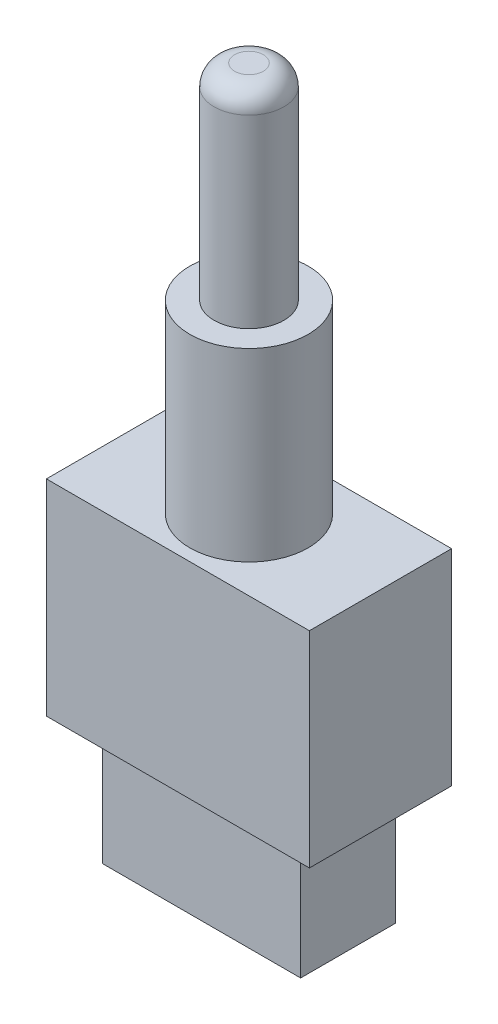
ISO-10303-21;
HEADER;
FILE_DESCRIPTION(('STEP AP214'),'2;1');
FILE_NAME('part.step','',(''),(''),'','','');
FILE_SCHEMA(('AUTOMOTIVE_DESIGN { 1 0 10303 214 1 1 1 1 }'));
ENDSEC;
DATA;
#1=APPLICATION_CONTEXT('core data for automotive mechanical design processes');
#2=APPLICATION_PROTOCOL_DEFINITION('international standard','automotive_design',2000,#1);
#3=PRODUCT_CONTEXT('',#1,'mechanical');
#4=PRODUCT('Part','Part','',(#3));
#5=PRODUCT_RELATED_PRODUCT_CATEGORY('part','',(#4));
#6=PRODUCT_DEFINITION_FORMATION('','',#4);
#7=PRODUCT_DEFINITION_CONTEXT('part definition',#1,'design');
#8=PRODUCT_DEFINITION('design','',#6,#7);
#9=PRODUCT_DEFINITION_SHAPE('','',#8);
#10=(LENGTH_UNIT() NAMED_UNIT(*) SI_UNIT(.MILLI.,.METRE.));
#11=(NAMED_UNIT(*) PLANE_ANGLE_UNIT() SI_UNIT($,.RADIAN.));
#12=(NAMED_UNIT(*) SI_UNIT($,.STERADIAN.) SOLID_ANGLE_UNIT());
#13=UNCERTAINTY_MEASURE_WITH_UNIT(LENGTH_MEASURE(1.E-05),#10,'distance_accuracy_value','');
#14=(GEOMETRIC_REPRESENTATION_CONTEXT(3) GLOBAL_UNCERTAINTY_ASSIGNED_CONTEXT((#13)) GLOBAL_UNIT_ASSIGNED_CONTEXT((#10,
#11,#12)) REPRESENTATION_CONTEXT('',''));
#15=CARTESIAN_POINT('',(0.,0.,0.));
#16=DIRECTION('',(0.,0.,1.));
#17=DIRECTION('',(1.,0.,0.));
#18=AXIS2_PLACEMENT_3D('',#15,#16,#17);
#19=CARTESIAN_POINT('',(0.,0.,0.));
#20=DIRECTION('',(0.,1.,0.));
#21=DIRECTION('',(0.,0.,1.));
#22=AXIS2_PLACEMENT_3D('',#19,#20,#21);
#23=PLANE('',#22);
#24=DIRECTION('',(0.,0.,1.));
#25=VECTOR('',#24,1.);
#26=CARTESIAN_POINT('',(-6.4,0.,-3.46));
#27=LINE('',#26,#25);
#28=CARTESIAN_POINT('',(-6.4,0.,-3.46));
#29=VERTEX_POINT('',#28);
#30=CARTESIAN_POINT('',(-6.4,0.,3.46));
#31=VERTEX_POINT('',#30);
#32=EDGE_CURVE('E133',#29,#31,#27,.T.);
#33=ORIENTED_EDGE('',*,*,#32,.F.);
#34=DIRECTION('',(-1.,0.,0.));
#35=VECTOR('',#34,1.);
#36=CARTESIAN_POINT('',(-6.4,0.,-3.46));
#37=LINE('',#36,#35);
#38=CARTESIAN_POINT('',(6.4,0.,-3.46));
#39=VERTEX_POINT('',#38);
#40=EDGE_CURVE('E153',#39,#29,#37,.T.);
#41=ORIENTED_EDGE('',*,*,#40,.F.);
#42=DIRECTION('',(0.,0.,-1.));
#43=VECTOR('',#42,1.);
#44=CARTESIAN_POINT('',(6.4,0.,-3.46));
#45=LINE('',#44,#43);
#46=CARTESIAN_POINT('',(6.4,0.,3.46));
#47=VERTEX_POINT('',#46);
#48=EDGE_CURVE('E169',#47,#39,#45,.T.);
#49=ORIENTED_EDGE('',*,*,#48,.F.);
#50=DIRECTION('',(1.,0.,0.));
#51=VECTOR('',#50,1.);
#52=CARTESIAN_POINT('',(-6.4,0.,3.46));
#53=LINE('',#52,#51);
#54=EDGE_CURVE('E166',#31,#47,#53,.T.);
#55=ORIENTED_EDGE('',*,*,#54,.F.);
#56=EDGE_LOOP('',(#33,#41,#49,#55));
#57=FACE_BOUND('',#56,.T.);
#58=DIRECTION('',(0.,0.,-1.));
#59=VECTOR('',#58,1.);
#60=CARTESIAN_POINT('',(-4.82433214275879,0.,-2.31090724413971));
#61=LINE('',#60,#59);
#62=CARTESIAN_POINT('',(-4.82433214275879,0.,2.31090724413971));
#63=VERTEX_POINT('',#62);
#64=CARTESIAN_POINT('',(-4.82433214275879,0.,-2.31090724413971));
#65=VERTEX_POINT('',#64);
#66=EDGE_CURVE('E55',#63,#65,#61,.T.);
#67=ORIENTED_EDGE('',*,*,#66,.F.);
#68=DIRECTION('',(-1.,0.,0.));
#69=VECTOR('',#68,1.);
#70=CARTESIAN_POINT('',(-4.82433214275879,0.,2.31090724413971));
#71=LINE('',#70,#69);
#72=CARTESIAN_POINT('',(4.82433214275879,0.,2.31090724413971));
#73=VERTEX_POINT('',#72);
#74=EDGE_CURVE('E59',#73,#63,#71,.T.);
#75=ORIENTED_EDGE('',*,*,#74,.F.);
#76=DIRECTION('',(0.,0.,1.));
#77=VECTOR('',#76,1.);
#78=CARTESIAN_POINT('',(4.82433214275879,0.,-2.31090724413971));
#79=LINE('',#78,#77);
#80=CARTESIAN_POINT('',(4.82433214275879,0.,-2.31090724413971));
#81=VERTEX_POINT('',#80);
#82=EDGE_CURVE('E360',#81,#73,#79,.T.);
#83=ORIENTED_EDGE('',*,*,#82,.F.);
#84=DIRECTION('',(1.,0.,0.));
#85=VECTOR('',#84,1.);
#86=CARTESIAN_POINT('',(-4.82433214275879,0.,-2.31090724413971));
#87=LINE('',#86,#85);
#88=EDGE_CURVE('E370',#65,#81,#87,.T.);
#89=ORIENTED_EDGE('',*,*,#88,.F.);
#90=EDGE_LOOP('',(#67,#75,#83,#89));
#91=FACE_BOUND('',#90,.T.);
#92=ADVANCED_FACE('F39',(#57,#91),#23,.F.);
#93=CARTESIAN_POINT('',(-6.4,10.,-3.46));
#94=DIRECTION('',(1.,0.,0.));
#95=DIRECTION('',(0.,0.,-1.));
#96=AXIS2_PLACEMENT_3D('',#93,#94,#95);
#97=PLANE('',#96);
#98=ORIENTED_EDGE('',*,*,#32,.T.);
#99=DIRECTION('',(0.,-1.,0.));
#100=VECTOR('',#99,1.);
#101=CARTESIAN_POINT('',(-6.4,10.,3.46));
#102=LINE('',#101,#100);
#103=CARTESIAN_POINT('',(-6.4,10.,3.46));
#104=VERTEX_POINT('',#103);
#105=EDGE_CURVE('E147',#104,#31,#102,.T.);
#106=ORIENTED_EDGE('',*,*,#105,.F.);
#107=DIRECTION('',(0.,0.,1.));
#108=VECTOR('',#107,1.);
#109=CARTESIAN_POINT('',(-6.4,10.,-3.46));
#110=LINE('',#109,#108);
#111=CARTESIAN_POINT('',(-6.4,10.,-3.46));
#112=VERTEX_POINT('',#111);
#113=EDGE_CURVE('E148',#112,#104,#110,.T.);
#114=ORIENTED_EDGE('',*,*,#113,.F.);
#115=DIRECTION('',(0.,-1.,0.));
#116=VECTOR('',#115,1.);
#117=CARTESIAN_POINT('',(-6.4,10.,-3.46));
#118=LINE('',#117,#116);
#119=EDGE_CURVE('E162',#112,#29,#118,.T.);
#120=ORIENTED_EDGE('',*,*,#119,.T.);
#121=EDGE_LOOP('',(#98,#106,#114,#120));
#122=FACE_BOUND('',#121,.T.);
#123=ADVANCED_FACE('F205',(#122),#97,.F.);
#124=CARTESIAN_POINT('',(-6.4,10.,3.46));
#125=DIRECTION('',(0.,0.,-1.));
#126=DIRECTION('',(-1.,0.,0.));
#127=AXIS2_PLACEMENT_3D('',#124,#125,#126);
#128=PLANE('',#127);
#129=ORIENTED_EDGE('',*,*,#54,.T.);
#130=DIRECTION('',(0.,-1.,0.));
#131=VECTOR('',#130,1.);
#132=CARTESIAN_POINT('',(6.4,10.,3.46));
#133=LINE('',#132,#131);
#134=CARTESIAN_POINT('',(6.4,10.,3.46));
#135=VERTEX_POINT('',#134);
#136=EDGE_CURVE('E181',#135,#47,#133,.T.);
#137=ORIENTED_EDGE('',*,*,#136,.F.);
#138=DIRECTION('',(1.,0.,0.));
#139=VECTOR('',#138,1.);
#140=CARTESIAN_POINT('',(-6.4,10.,3.46));
#141=LINE('',#140,#139);
#142=EDGE_CURVE('E152',#104,#135,#141,.T.);
#143=ORIENTED_EDGE('',*,*,#142,.F.);
#144=ORIENTED_EDGE('',*,*,#105,.T.);
#145=EDGE_LOOP('',(#129,#137,#143,#144));
#146=FACE_BOUND('',#145,.T.);
#147=ADVANCED_FACE('F212',(#146),#128,.F.);
#148=CARTESIAN_POINT('',(6.4,10.,-3.46));
#149=DIRECTION('',(-1.,0.,0.));
#150=DIRECTION('',(0.,0.,1.));
#151=AXIS2_PLACEMENT_3D('',#148,#149,#150);
#152=PLANE('',#151);
#153=ORIENTED_EDGE('',*,*,#48,.T.);
#154=DIRECTION('',(0.,-1.,0.));
#155=VECTOR('',#154,1.);
#156=CARTESIAN_POINT('',(6.4,10.,-3.46));
#157=LINE('',#156,#155);
#158=CARTESIAN_POINT('',(6.4,10.,-3.46));
#159=VERTEX_POINT('',#158);
#160=EDGE_CURVE('E177',#159,#39,#157,.T.);
#161=ORIENTED_EDGE('',*,*,#160,.F.);
#162=DIRECTION('',(0.,0.,-1.));
#163=VECTOR('',#162,1.);
#164=CARTESIAN_POINT('',(6.4,10.,-3.46));
#165=LINE('',#164,#163);
#166=EDGE_CURVE('E156',#135,#159,#165,.T.);
#167=ORIENTED_EDGE('',*,*,#166,.F.);
#168=ORIENTED_EDGE('',*,*,#136,.T.);
#169=EDGE_LOOP('',(#153,#161,#167,#168));
#170=FACE_BOUND('',#169,.T.);
#171=ADVANCED_FACE('F222',(#170),#152,.F.);
#172=CARTESIAN_POINT('',(-6.4,10.,-3.46));
#173=DIRECTION('',(0.,0.,1.));
#174=DIRECTION('',(1.,0.,0.));
#175=AXIS2_PLACEMENT_3D('',#172,#173,#174);
#176=PLANE('',#175);
#177=ORIENTED_EDGE('',*,*,#40,.T.);
#178=ORIENTED_EDGE('',*,*,#119,.F.);
#179=DIRECTION('',(-1.,0.,0.));
#180=VECTOR('',#179,1.);
#181=CARTESIAN_POINT('',(-6.4,10.,-3.46));
#182=LINE('',#181,#180);
#183=EDGE_CURVE('E159',#159,#112,#182,.T.);
#184=ORIENTED_EDGE('',*,*,#183,.F.);
#185=ORIENTED_EDGE('',*,*,#160,.T.);
#186=EDGE_LOOP('',(#177,#178,#184,#185));
#187=FACE_BOUND('',#186,.T.);
#188=ADVANCED_FACE('F219',(#187),#176,.F.);
#189=CARTESIAN_POINT('',(0.,10.,0.));
#190=DIRECTION('',(0.,1.,0.));
#191=DIRECTION('',(0.,0.,1.));
#192=AXIS2_PLACEMENT_3D('',#189,#190,#191);
#193=PLANE('',#192);
#194=CARTESIAN_POINT('',(0.,10.,0.));
#195=DIRECTION('',(0.,1.,0.));
#196=DIRECTION('',(0.,0.,1.));
#197=AXIS2_PLACEMENT_3D('',#194,#195,#196);
#198=CIRCLE('',#197,2.88);
#199=CARTESIAN_POINT('',(0.,10.,2.88));
#200=VERTEX_POINT('',#199);
#201=EDGE_CURVE('E142',#200,#200,#198,.T.);
#202=ORIENTED_EDGE('',*,*,#201,.F.);
#203=EDGE_LOOP('',(#202));
#204=FACE_BOUND('',#203,.T.);
#205=ORIENTED_EDGE('',*,*,#113,.T.);
#206=ORIENTED_EDGE('',*,*,#142,.T.);
#207=ORIENTED_EDGE('',*,*,#166,.T.);
#208=ORIENTED_EDGE('',*,*,#183,.T.);
#209=EDGE_LOOP('',(#205,#206,#207,#208));
#210=FACE_BOUND('',#209,.T.);
#211=ADVANCED_FACE('F217',(#204,#210),#193,.T.);
#212=CARTESIAN_POINT('',(0.,19.,0.));
#213=DIRECTION('',(0.,-1.,0.));
#214=DIRECTION('',(0.,0.,-1.));
#215=AXIS2_PLACEMENT_3D('',#212,#213,#214);
#216=CYLINDRICAL_SURFACE('',#215,2.88);
#217=CARTESIAN_POINT('',(0.,19.,0.));
#218=DIRECTION('',(0.,1.,0.));
#219=DIRECTION('',(0.,0.,1.));
#220=AXIS2_PLACEMENT_3D('',#217,#218,#219);
#221=CIRCLE('',#220,2.88);
#222=CARTESIAN_POINT('',(0.,19.,2.88));
#223=VERTEX_POINT('',#222);
#224=EDGE_CURVE('E128',#223,#223,#221,.T.);
#225=ORIENTED_EDGE('',*,*,#224,.F.);
#226=EDGE_LOOP('',(#225));
#227=FACE_BOUND('',#226,.T.);
#228=ORIENTED_EDGE('',*,*,#201,.T.);
#229=EDGE_LOOP('',(#228));
#230=FACE_BOUND('',#229,.T.);
#231=ADVANCED_FACE('F242',(#227,#230),#216,.T.);
#232=CARTESIAN_POINT('',(0.,19.,0.));
#233=DIRECTION('',(0.,1.,0.));
#234=DIRECTION('',(0.,0.,1.));
#235=AXIS2_PLACEMENT_3D('',#232,#233,#234);
#236=PLANE('',#235);
#237=CARTESIAN_POINT('',(0.,19.,0.));
#238=DIRECTION('',(0.,1.,0.));
#239=DIRECTION('',(0.,0.,1.));
#240=AXIS2_PLACEMENT_3D('',#237,#238,#239);
#241=CIRCLE('',#240,1.69900925132393);
#242=CARTESIAN_POINT('',(0.,19.,1.69900925132393));
#243=VERTEX_POINT('',#242);
#244=EDGE_CURVE('E139',#243,#243,#241,.T.);
#245=ORIENTED_EDGE('',*,*,#244,.F.);
#246=EDGE_LOOP('',(#245));
#247=FACE_BOUND('',#246,.T.);
#248=ORIENTED_EDGE('',*,*,#224,.T.);
#249=EDGE_LOOP('',(#248));
#250=FACE_BOUND('',#249,.T.);
#251=ADVANCED_FACE('F247',(#247,#250),#236,.T.);
#252=CARTESIAN_POINT('',(0.,29.,0.));
#253=DIRECTION('',(0.,-1.,0.));
#254=DIRECTION('',(0.,0.,-1.));
#255=AXIS2_PLACEMENT_3D('',#252,#253,#254);
#256=CYLINDRICAL_SURFACE('',#255,1.69900925132393);
#257=CARTESIAN_POINT('',(0.,28.,0.));
#258=DIRECTION('',(0.,1.,0.));
#259=DIRECTION('',(0.,0.,1.));
#260=AXIS2_PLACEMENT_3D('',#257,#258,#259);
#261=CIRCLE('',#260,1.69900925132393);
#262=CARTESIAN_POINT('',(0.,28.,1.69900925132393));
#263=VERTEX_POINT('',#262);
#264=EDGE_CURVE('E11',#263,#263,#261,.F.);
#265=ORIENTED_EDGE('',*,*,#264,.T.);
#266=EDGE_LOOP('',(#265));
#267=FACE_BOUND('',#266,.T.);
#268=ORIENTED_EDGE('',*,*,#244,.T.);
#269=EDGE_LOOP('',(#268));
#270=FACE_BOUND('',#269,.T.);
#271=ADVANCED_FACE('F201',(#267,#270),#256,.T.);
#272=CARTESIAN_POINT('',(0.,29.,0.));
#273=DIRECTION('',(0.,1.,0.));
#274=DIRECTION('',(0.,0.,1.));
#275=AXIS2_PLACEMENT_3D('',#272,#273,#274);
#276=PLANE('',#275);
#277=CARTESIAN_POINT('',(0.,29.,0.));
#278=DIRECTION('',(0.,1.,0.));
#279=DIRECTION('',(0.,0.,1.));
#280=AXIS2_PLACEMENT_3D('',#277,#278,#279);
#281=CIRCLE('',#280,0.699009251323928);
#282=CARTESIAN_POINT('',(0.,29.,0.699009251323928));
#283=VERTEX_POINT('',#282);
#284=EDGE_CURVE('E48',#283,#283,#281,.T.);
#285=ORIENTED_EDGE('',*,*,#284,.T.);
#286=EDGE_LOOP('',(#285));
#287=FACE_BOUND('',#286,.T.);
#288=ADVANCED_FACE('F191',(#287),#276,.T.);
#289=CARTESIAN_POINT('',(0.,28.,0.));
#290=DIRECTION('',(0.,1.,0.));
#291=DIRECTION('',(0.,0.,1.));
#292=AXIS2_PLACEMENT_3D('',#289,#290,#291);
#293=DEGENERATE_TOROIDAL_SURFACE('',#292,0.699009251323928,1.,.T.);
#294=ORIENTED_EDGE('',*,*,#264,.F.);
#295=EDGE_LOOP('',(#294));
#296=FACE_BOUND('',#295,.T.);
#297=ORIENTED_EDGE('',*,*,#284,.F.);
#298=EDGE_LOOP('',(#297));
#299=FACE_BOUND('',#298,.T.);
#300=ADVANCED_FACE('F41',(#296,#299),#293,.T.);
#301=CARTESIAN_POINT('',(-4.82433214275879,-6.,-2.31090724413971));
#302=DIRECTION('',(1.,0.,0.));
#303=DIRECTION('',(0.,0.,-1.));
#304=AXIS2_PLACEMENT_3D('',#301,#302,#303);
#305=PLANE('',#304);
#306=ORIENTED_EDGE('',*,*,#66,.T.);
#307=DIRECTION('',(0.,1.,0.));
#308=VECTOR('',#307,1.);
#309=CARTESIAN_POINT('',(-4.82433214275879,-6.,-2.31090724413971));
#310=LINE('',#309,#308);
#311=CARTESIAN_POINT('',(-4.82433214275879,-6.,-2.31090724413971));
#312=VERTEX_POINT('',#311);
#313=EDGE_CURVE('E108',#312,#65,#310,.T.);
#314=ORIENTED_EDGE('',*,*,#313,.F.);
#315=DIRECTION('',(0.,0.,-1.));
#316=VECTOR('',#315,1.);
#317=CARTESIAN_POINT('',(-4.82433214275879,-6.,-2.31090724413971));
#318=LINE('',#317,#316);
#319=CARTESIAN_POINT('',(-4.82433214275879,-6.,2.31090724413971));
#320=VERTEX_POINT('',#319);
#321=EDGE_CURVE('E115',#320,#312,#318,.T.);
#322=ORIENTED_EDGE('',*,*,#321,.F.);
#323=DIRECTION('',(0.,1.,0.));
#324=VECTOR('',#323,1.);
#325=CARTESIAN_POINT('',(-4.82433214275879,-6.,2.31090724413971));
#326=LINE('',#325,#324);
#327=EDGE_CURVE('E357',#320,#63,#326,.T.);
#328=ORIENTED_EDGE('',*,*,#327,.T.);
#329=EDGE_LOOP('',(#306,#314,#322,#328));
#330=FACE_BOUND('',#329,.T.);
#331=ADVANCED_FACE('F126',(#330),#305,.F.);
#332=CARTESIAN_POINT('',(-4.82433214275879,-6.,-2.31090724413971));
#333=DIRECTION('',(0.,0.,1.));
#334=DIRECTION('',(1.,0.,0.));
#335=AXIS2_PLACEMENT_3D('',#332,#333,#334);
#336=PLANE('',#335);
#337=ORIENTED_EDGE('',*,*,#88,.T.);
#338=DIRECTION('',(0.,1.,0.));
#339=VECTOR('',#338,1.);
#340=CARTESIAN_POINT('',(4.82433214275879,-6.,-2.31090724413971));
#341=LINE('',#340,#339);
#342=CARTESIAN_POINT('',(4.82433214275879,-6.,-2.31090724413971));
#343=VERTEX_POINT('',#342);
#344=EDGE_CURVE('E110',#343,#81,#341,.T.);
#345=ORIENTED_EDGE('',*,*,#344,.F.);
#346=DIRECTION('',(1.,0.,0.));
#347=VECTOR('',#346,1.);
#348=CARTESIAN_POINT('',(-4.82433214275879,-6.,-2.31090724413971));
#349=LINE('',#348,#347);
#350=EDGE_CURVE('E103',#312,#343,#349,.T.);
#351=ORIENTED_EDGE('',*,*,#350,.F.);
#352=ORIENTED_EDGE('',*,*,#313,.T.);
#353=EDGE_LOOP('',(#337,#345,#351,#352));
#354=FACE_BOUND('',#353,.T.);
#355=ADVANCED_FACE('F106',(#354),#336,.F.);
#356=CARTESIAN_POINT('',(4.82433214275879,-6.,-2.31090724413971));
#357=DIRECTION('',(-1.,0.,0.));
#358=DIRECTION('',(0.,0.,1.));
#359=AXIS2_PLACEMENT_3D('',#356,#357,#358);
#360=PLANE('',#359);
#361=ORIENTED_EDGE('',*,*,#82,.T.);
#362=DIRECTION('',(0.,1.,0.));
#363=VECTOR('',#362,1.);
#364=CARTESIAN_POINT('',(4.82433214275879,-6.,2.31090724413971));
#365=LINE('',#364,#363);
#366=CARTESIAN_POINT('',(4.82433214275879,-6.,2.31090724413971));
#367=VERTEX_POINT('',#366);
#368=EDGE_CURVE('E135',#367,#73,#365,.T.);
#369=ORIENTED_EDGE('',*,*,#368,.F.);
#370=DIRECTION('',(0.,0.,1.));
#371=VECTOR('',#370,1.);
#372=CARTESIAN_POINT('',(4.82433214275879,-6.,-2.31090724413971));
#373=LINE('',#372,#371);
#374=EDGE_CURVE('E114',#343,#367,#373,.T.);
#375=ORIENTED_EDGE('',*,*,#374,.F.);
#376=ORIENTED_EDGE('',*,*,#344,.T.);
#377=EDGE_LOOP('',(#361,#369,#375,#376));
#378=FACE_BOUND('',#377,.T.);
#379=ADVANCED_FACE('F263',(#378),#360,.F.);
#380=CARTESIAN_POINT('',(-4.82433214275879,-6.,2.31090724413971));
#381=DIRECTION('',(0.,0.,-1.));
#382=DIRECTION('',(-1.,0.,0.));
#383=AXIS2_PLACEMENT_3D('',#380,#381,#382);
#384=PLANE('',#383);
#385=ORIENTED_EDGE('',*,*,#74,.T.);
#386=ORIENTED_EDGE('',*,*,#327,.F.);
#387=DIRECTION('',(-1.,0.,0.));
#388=VECTOR('',#387,1.);
#389=CARTESIAN_POINT('',(-4.82433214275879,-6.,2.31090724413971));
#390=LINE('',#389,#388);
#391=EDGE_CURVE('E120',#367,#320,#390,.T.);
#392=ORIENTED_EDGE('',*,*,#391,.F.);
#393=ORIENTED_EDGE('',*,*,#368,.T.);
#394=EDGE_LOOP('',(#385,#386,#392,#393));
#395=FACE_BOUND('',#394,.T.);
#396=ADVANCED_FACE('F266',(#395),#384,.F.);
#397=CARTESIAN_POINT('',(0.,-6.,0.));
#398=DIRECTION('',(0.,1.,0.));
#399=DIRECTION('',(0.,0.,1.));
#400=AXIS2_PLACEMENT_3D('',#397,#398,#399);
#401=PLANE('',#400);
#402=ORIENTED_EDGE('',*,*,#321,.T.);
#403=ORIENTED_EDGE('',*,*,#350,.T.);
#404=ORIENTED_EDGE('',*,*,#374,.T.);
#405=ORIENTED_EDGE('',*,*,#391,.T.);
#406=EDGE_LOOP('',(#402,#403,#404,#405));
#407=FACE_BOUND('',#406,.T.);
#408=ADVANCED_FACE('F118',(#407),#401,.F.);
#409=CLOSED_SHELL('',(#92,#123,#147,#171,#188,#211,#231,#251,#271,#288,#300,#331,#355,#379,#396,#408));
#410=MANIFOLD_SOLID_BREP('B2',#409);
#411=ADVANCED_BREP_SHAPE_REPRESENTATION('',(#18,#410),#14);
#412=SHAPE_DEFINITION_REPRESENTATION(#9,#411);
ENDSEC;
END-ISO-10303-21;
